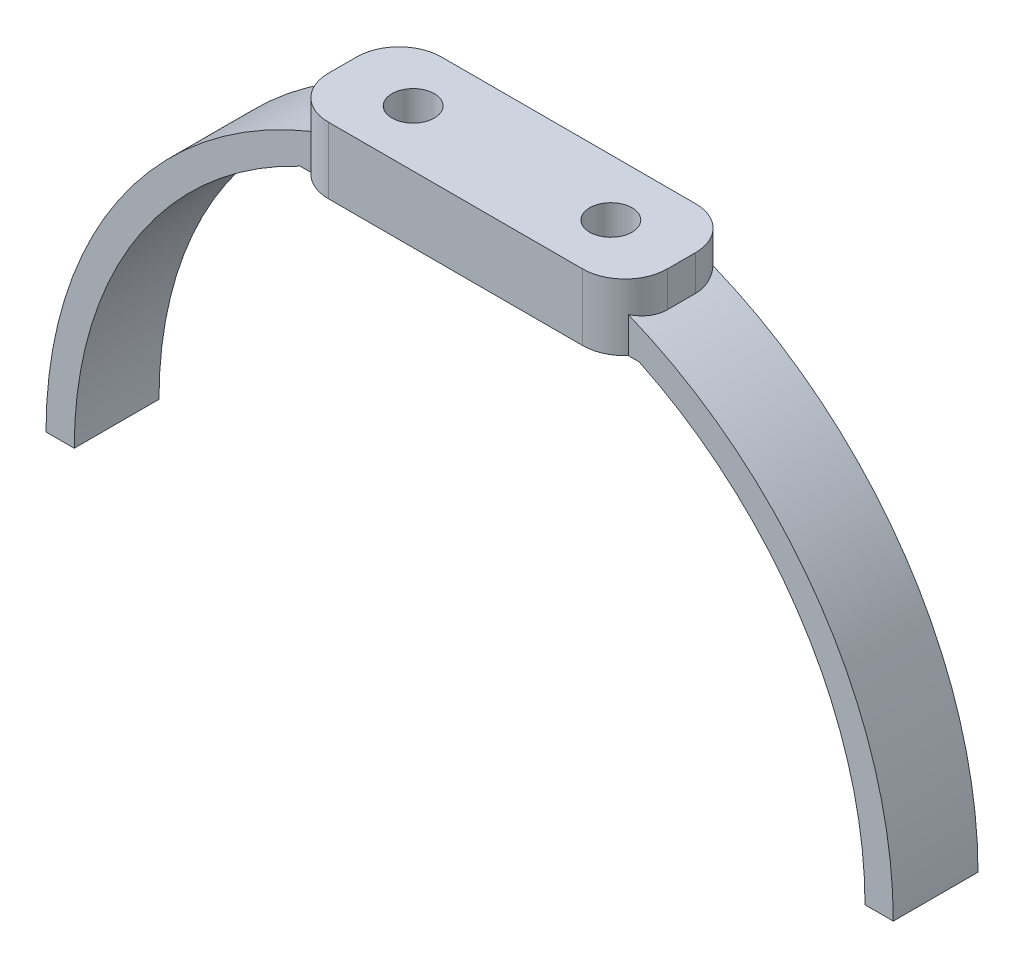
ISO-10303-21;
HEADER;
FILE_DESCRIPTION(('STEP AP214'),'2;1');
FILE_NAME('part.step','',(''),(''),'','','');
FILE_SCHEMA(('AUTOMOTIVE_DESIGN { 1 0 10303 214 1 1 1 1 }'));
ENDSEC;
DATA;
#1=APPLICATION_CONTEXT('core data for automotive mechanical design processes');
#2=APPLICATION_PROTOCOL_DEFINITION('international standard','automotive_design',2000,#1);
#3=PRODUCT_CONTEXT('',#1,'mechanical');
#4=PRODUCT('Part','Part','',(#3));
#5=PRODUCT_RELATED_PRODUCT_CATEGORY('part','',(#4));
#6=PRODUCT_DEFINITION_FORMATION('','',#4);
#7=PRODUCT_DEFINITION_CONTEXT('part definition',#1,'design');
#8=PRODUCT_DEFINITION('design','',#6,#7);
#9=PRODUCT_DEFINITION_SHAPE('','',#8);
#10=(LENGTH_UNIT() NAMED_UNIT(*) SI_UNIT(.MILLI.,.METRE.));
#11=(NAMED_UNIT(*) PLANE_ANGLE_UNIT() SI_UNIT($,.RADIAN.));
#12=(NAMED_UNIT(*) SI_UNIT($,.STERADIAN.) SOLID_ANGLE_UNIT());
#13=UNCERTAINTY_MEASURE_WITH_UNIT(LENGTH_MEASURE(1.E-05),#10,'distance_accuracy_value','');
#14=(GEOMETRIC_REPRESENTATION_CONTEXT(3) GLOBAL_UNCERTAINTY_ASSIGNED_CONTEXT((#13)) GLOBAL_UNIT_ASSIGNED_CONTEXT((#10,
#11,#12)) REPRESENTATION_CONTEXT('',''));
#15=CARTESIAN_POINT('',(0.,0.,0.));
#16=DIRECTION('',(0.,0.,1.));
#17=DIRECTION('',(1.,0.,0.));
#18=AXIS2_PLACEMENT_3D('',#15,#16,#17);
#19=CARTESIAN_POINT('',(-12.,-1.,-4.));
#20=DIRECTION('',(-1.,0.,0.));
#21=DIRECTION('',(0.,0.,1.));
#22=AXIS2_PLACEMENT_3D('',#19,#20,#21);
#23=PLANE('',#22);
#24=DIRECTION('',(0.,0.,1.));
#25=VECTOR('',#24,1.);
#26=CARTESIAN_POINT('',(-12.,-2.50454583026497,-3.));
#27=LINE('',#26,#25);
#28=CARTESIAN_POINT('',(-12.,-2.50454583026497,-1.));
#29=VERTEX_POINT('',#28);
#30=CARTESIAN_POINT('',(-12.,-2.50454583026497,1.));
#31=VERTEX_POINT('',#30);
#32=EDGE_CURVE('E225',#29,#31,#27,.T.);
#33=ORIENTED_EDGE('',*,*,#32,.T.);
#34=DIRECTION('',(0.,1.,0.));
#35=VECTOR('',#34,1.);
#36=CARTESIAN_POINT('',(-12.,-1.,1.));
#37=LINE('',#36,#35);
#38=CARTESIAN_POINT('',(-12.,0.,1.));
#39=VERTEX_POINT('',#38);
#40=EDGE_CURVE('E259',#31,#39,#37,.T.);
#41=ORIENTED_EDGE('',*,*,#40,.T.);
#42=DIRECTION('',(0.,0.,1.));
#43=VECTOR('',#42,1.);
#44=CARTESIAN_POINT('',(-12.,0.,-4.));
#45=LINE('',#44,#43);
#46=CARTESIAN_POINT('',(-12.,0.,-1.));
#47=VERTEX_POINT('',#46);
#48=EDGE_CURVE('E239',#47,#39,#45,.T.);
#49=ORIENTED_EDGE('',*,*,#48,.F.);
#50=DIRECTION('',(0.,1.,0.));
#51=VECTOR('',#50,1.);
#52=CARTESIAN_POINT('',(-12.,-1.,-1.));
#53=LINE('',#52,#51);
#54=EDGE_CURVE('E251',#47,#29,#53,.F.);
#55=ORIENTED_EDGE('',*,*,#54,.T.);
#56=EDGE_LOOP('',(#33,#41,#49,#55));
#57=FACE_BOUND('',#56,.T.);
#58=ADVANCED_FACE('F37',(#57),#23,.T.);
#59=CARTESIAN_POINT('',(12.,-1.,-4.));
#60=DIRECTION('',(1.,0.,0.));
#61=DIRECTION('',(0.,0.,-1.));
#62=AXIS2_PLACEMENT_3D('',#59,#60,#61);
#63=PLANE('',#62);
#64=DIRECTION('',(0.,0.,-1.));
#65=VECTOR('',#64,1.);
#66=CARTESIAN_POINT('',(12.,0.,-4.));
#67=LINE('',#66,#65);
#68=CARTESIAN_POINT('',(12.,0.,1.));
#69=VERTEX_POINT('',#68);
#70=CARTESIAN_POINT('',(12.,0.,-1.));
#71=VERTEX_POINT('',#70);
#72=EDGE_CURVE('E245',#69,#71,#67,.T.);
#73=ORIENTED_EDGE('',*,*,#72,.F.);
#74=DIRECTION('',(0.,1.,0.));
#75=VECTOR('',#74,1.);
#76=CARTESIAN_POINT('',(12.,-1.,1.));
#77=LINE('',#76,#75);
#78=CARTESIAN_POINT('',(12.,-2.50454583026497,1.));
#79=VERTEX_POINT('',#78);
#80=EDGE_CURVE('E301',#69,#79,#77,.F.);
#81=ORIENTED_EDGE('',*,*,#80,.T.);
#82=DIRECTION('',(0.,0.,1.));
#83=VECTOR('',#82,1.);
#84=CARTESIAN_POINT('',(12.,-2.50454583026497,-3.));
#85=LINE('',#84,#83);
#86=CARTESIAN_POINT('',(12.,-2.50454583026497,-1.));
#87=VERTEX_POINT('',#86);
#88=EDGE_CURVE('E219',#79,#87,#85,.F.);
#89=ORIENTED_EDGE('',*,*,#88,.T.);
#90=DIRECTION('',(0.,1.,0.));
#91=VECTOR('',#90,1.);
#92=CARTESIAN_POINT('',(12.,-1.,-1.));
#93=LINE('',#92,#91);
#94=EDGE_CURVE('E298',#87,#71,#93,.T.);
#95=ORIENTED_EDGE('',*,*,#94,.T.);
#96=EDGE_LOOP('',(#73,#81,#89,#95));
#97=FACE_BOUND('',#96,.T.);
#98=ADVANCED_FACE('F359',(#97),#63,.T.);
#99=CARTESIAN_POINT('',(12.,-1.,-4.));
#100=DIRECTION('',(0.,0.,-1.));
#101=DIRECTION('',(-1.,0.,0.));
#102=AXIS2_PLACEMENT_3D('',#99,#100,#101);
#103=PLANE('',#102);
#104=DIRECTION('',(1.,0.,0.));
#105=VECTOR('',#104,1.);
#106=CARTESIAN_POINT('',(-12.,-4.70177871865297,-4.));
#107=LINE('',#106,#105);
#108=CARTESIAN_POINT('',(-9.,-4.70177871865297,-4.));
#109=VERTEX_POINT('',#108);
#110=CARTESIAN_POINT('',(9.00000000000001,-4.70177871865297,-4.));
#111=VERTEX_POINT('',#110);
#112=EDGE_CURVE('E231',#109,#111,#107,.T.);
#113=ORIENTED_EDGE('',*,*,#112,.F.);
#114=DIRECTION('',(0.,1.,0.));
#115=VECTOR('',#114,1.);
#116=CARTESIAN_POINT('',(-9.,-1.,-4.));
#117=LINE('',#116,#115);
#118=CARTESIAN_POINT('',(-8.99999999999999,0.,-4.));
#119=VERTEX_POINT('',#118);
#120=EDGE_CURVE('E295',#109,#119,#117,.T.);
#121=ORIENTED_EDGE('',*,*,#120,.T.);
#122=DIRECTION('',(-1.,0.,0.));
#123=VECTOR('',#122,1.);
#124=CARTESIAN_POINT('',(12.,0.,-4.));
#125=LINE('',#124,#123);
#126=CARTESIAN_POINT('',(9.00000000000001,0.,-4.));
#127=VERTEX_POINT('',#126);
#128=EDGE_CURVE('E248',#127,#119,#125,.T.);
#129=ORIENTED_EDGE('',*,*,#128,.F.);
#130=DIRECTION('',(0.,1.,0.));
#131=VECTOR('',#130,1.);
#132=CARTESIAN_POINT('',(9.00000000000001,-1.,-4.));
#133=LINE('',#132,#131);
#134=EDGE_CURVE('E293',#127,#111,#133,.F.);
#135=ORIENTED_EDGE('',*,*,#134,.T.);
#136=EDGE_LOOP('',(#113,#121,#129,#135));
#137=FACE_BOUND('',#136,.T.);
#138=ADVANCED_FACE('F379',(#137),#103,.T.);
#139=CARTESIAN_POINT('',(12.,-1.,4.));
#140=DIRECTION('',(0.,0.,1.));
#141=DIRECTION('',(1.,0.,0.));
#142=AXIS2_PLACEMENT_3D('',#139,#140,#141);
#143=PLANE('',#142);
#144=DIRECTION('',(1.,0.,0.));
#145=VECTOR('',#144,1.);
#146=CARTESIAN_POINT('',(12.,0.,4.));
#147=LINE('',#146,#145);
#148=CARTESIAN_POINT('',(-9.,0.,4.));
#149=VERTEX_POINT('',#148);
#150=CARTESIAN_POINT('',(9.,0.,4.));
#151=VERTEX_POINT('',#150);
#152=EDGE_CURVE('E242',#149,#151,#147,.T.);
#153=ORIENTED_EDGE('',*,*,#152,.F.);
#154=DIRECTION('',(0.,1.,0.));
#155=VECTOR('',#154,1.);
#156=CARTESIAN_POINT('',(-9.,-1.,4.));
#157=LINE('',#156,#155);
#158=CARTESIAN_POINT('',(-9.,-4.70177871865297,4.));
#159=VERTEX_POINT('',#158);
#160=EDGE_CURVE('E273',#149,#159,#157,.F.);
#161=ORIENTED_EDGE('',*,*,#160,.T.);
#162=DIRECTION('',(1.,0.,0.));
#163=VECTOR('',#162,1.);
#164=CARTESIAN_POINT('',(-12.,-4.70177871865297,4.));
#165=LINE('',#164,#163);
#166=CARTESIAN_POINT('',(9.00000000000001,-4.70177871865297,4.));
#167=VERTEX_POINT('',#166);
#168=EDGE_CURVE('E228',#159,#167,#165,.T.);
#169=ORIENTED_EDGE('',*,*,#168,.T.);
#170=DIRECTION('',(0.,1.,0.));
#171=VECTOR('',#170,1.);
#172=CARTESIAN_POINT('',(9.,-1.,4.));
#173=LINE('',#172,#171);
#174=EDGE_CURVE('E270',#167,#151,#173,.T.);
#175=ORIENTED_EDGE('',*,*,#174,.T.);
#176=EDGE_LOOP('',(#153,#161,#169,#175));
#177=FACE_BOUND('',#176,.T.);
#178=ADVANCED_FACE('F387',(#177),#143,.T.);
#179=CARTESIAN_POINT('',(0.,0.,0.));
#180=DIRECTION('',(0.,-1.,0.));
#181=DIRECTION('',(0.,0.,-1.));
#182=AXIS2_PLACEMENT_3D('',#179,#180,#181);
#183=PLANE('',#182);
#184=CARTESIAN_POINT('',(-7.,0.,0.));
#185=DIRECTION('',(0.,1.,0.));
#186=DIRECTION('',(0.,0.,1.));
#187=AXIS2_PLACEMENT_3D('',#184,#185,#186);
#188=CIRCLE('',#187,1.5);
#189=CARTESIAN_POINT('',(-7.,0.,1.5));
#190=VERTEX_POINT('',#189);
#191=EDGE_CURVE('E255',#190,#190,#188,.T.);
#192=ORIENTED_EDGE('',*,*,#191,.F.);
#193=EDGE_LOOP('',(#192));
#194=FACE_BOUND('',#193,.T.);
#195=CARTESIAN_POINT('',(7.,0.,0.));
#196=DIRECTION('',(0.,1.,0.));
#197=DIRECTION('',(0.,0.,1.));
#198=AXIS2_PLACEMENT_3D('',#195,#196,#197);
#199=CIRCLE('',#198,1.5);
#200=CARTESIAN_POINT('',(7.,0.,1.5));
#201=VERTEX_POINT('',#200);
#202=EDGE_CURVE('E199',#201,#201,#199,.T.);
#203=ORIENTED_EDGE('',*,*,#202,.F.);
#204=EDGE_LOOP('',(#203));
#205=FACE_BOUND('',#204,.T.);
#206=ORIENTED_EDGE('',*,*,#48,.T.);
#207=CARTESIAN_POINT('',(-9.,0.,1.));
#208=DIRECTION('',(0.,-1.,0.));
#209=DIRECTION('',(0.,0.,-1.));
#210=AXIS2_PLACEMENT_3D('',#207,#208,#209);
#211=CIRCLE('',#210,3.);
#212=EDGE_CURVE('E268',#39,#149,#211,.F.);
#213=ORIENTED_EDGE('',*,*,#212,.T.);
#214=ORIENTED_EDGE('',*,*,#152,.T.);
#215=CARTESIAN_POINT('',(9.,0.,0.999999999999999));
#216=DIRECTION('',(0.,-1.,0.));
#217=DIRECTION('',(0.,0.,-1.));
#218=AXIS2_PLACEMENT_3D('',#215,#216,#217);
#219=CIRCLE('',#218,3.);
#220=EDGE_CURVE('E264',#151,#69,#219,.F.);
#221=ORIENTED_EDGE('',*,*,#220,.T.);
#222=ORIENTED_EDGE('',*,*,#72,.T.);
#223=CARTESIAN_POINT('',(9.00000000000001,0.,-1.));
#224=DIRECTION('',(0.,-1.,0.));
#225=DIRECTION('',(0.,0.,-1.));
#226=AXIS2_PLACEMENT_3D('',#223,#224,#225);
#227=CIRCLE('',#226,3.);
#228=EDGE_CURVE('E262',#71,#127,#227,.F.);
#229=ORIENTED_EDGE('',*,*,#228,.T.);
#230=ORIENTED_EDGE('',*,*,#128,.T.);
#231=CARTESIAN_POINT('',(-9.,0.,-1.));
#232=DIRECTION('',(0.,-1.,0.));
#233=DIRECTION('',(0.,0.,-1.));
#234=AXIS2_PLACEMENT_3D('',#231,#232,#233);
#235=CIRCLE('',#234,3.);
#236=EDGE_CURVE('E266',#119,#47,#235,.F.);
#237=ORIENTED_EDGE('',*,*,#236,.T.);
#238=EDGE_LOOP('',(#206,#213,#214,#221,#222,#229,#230,#237));
#239=FACE_BOUND('',#238,.T.);
#240=ADVANCED_FACE('F382',(#194,#205,#239),#183,.F.);
#241=CARTESIAN_POINT('',(-12.,-4.70177871865297,-28.4562205403692));
#242=DIRECTION('',(0.,-1.,0.));
#243=DIRECTION('',(0.,0.,-1.));
#244=AXIS2_PLACEMENT_3D('',#241,#242,#243);
#245=PLANE('',#244);
#246=CARTESIAN_POINT('',(-7.,-4.70177871865297,0.));
#247=DIRECTION('',(0.,-1.,0.));
#248=DIRECTION('',(0.,0.,-1.));
#249=AXIS2_PLACEMENT_3D('',#246,#247,#248);
#250=CIRCLE('',#249,1.5);
#251=CARTESIAN_POINT('',(-7.,-4.70177871865297,1.5));
#252=VERTEX_POINT('',#251);
#253=EDGE_CURVE('E197',#252,#252,#250,.T.);
#254=ORIENTED_EDGE('',*,*,#253,.F.);
#255=EDGE_LOOP('',(#254));
#256=FACE_BOUND('',#255,.T.);
#257=CARTESIAN_POINT('',(7.,-4.70177871865297,0.));
#258=DIRECTION('',(0.,-1.,0.));
#259=DIRECTION('',(0.,0.,-1.));
#260=AXIS2_PLACEMENT_3D('',#257,#258,#259);
#261=CIRCLE('',#260,1.5);
#262=CARTESIAN_POINT('',(7.,-4.70177871865297,1.5));
#263=VERTEX_POINT('',#262);
#264=EDGE_CURVE('E252',#263,#263,#261,.T.);
#265=ORIENTED_EDGE('',*,*,#264,.F.);
#266=EDGE_LOOP('',(#265));
#267=FACE_BOUND('',#266,.T.);
#268=CARTESIAN_POINT('',(-9.,-4.70177871865297,1.));
#269=DIRECTION('',(0.,-1.,0.));
#270=DIRECTION('',(0.,0.,-1.));
#271=AXIS2_PLACEMENT_3D('',#268,#269,#270);
#272=CIRCLE('',#271,3.);
#273=CARTESIAN_POINT('',(-11.2360679774998,-4.70177871865297,3.));
#274=VERTEX_POINT('',#273);
#275=EDGE_CURVE('E288',#159,#274,#272,.T.);
#276=ORIENTED_EDGE('',*,*,#275,.T.);
#277=DIRECTION('',(-1.,0.,0.));
#278=VECTOR('',#277,1.);
#279=CARTESIAN_POINT('',(-12.,-4.70177871865297,3.));
#280=LINE('',#279,#278);
#281=CARTESIAN_POINT('',(-12.,-4.70177871865297,3.));
#282=VERTEX_POINT('',#281);
#283=EDGE_CURVE('E291',#274,#282,#280,.T.);
#284=ORIENTED_EDGE('',*,*,#283,.T.);
#285=DIRECTION('',(0.,0.,1.));
#286=VECTOR('',#285,1.);
#287=CARTESIAN_POINT('',(-12.,-4.70177871865297,-28.4562205403692));
#288=LINE('',#287,#286);
#289=CARTESIAN_POINT('',(-12.,-4.70177871865297,-3.));
#290=VERTEX_POINT('',#289);
#291=EDGE_CURVE('E236',#290,#282,#288,.T.);
#292=ORIENTED_EDGE('',*,*,#291,.F.);
#293=DIRECTION('',(1.,0.,0.));
#294=VECTOR('',#293,1.);
#295=CARTESIAN_POINT('',(0.,-4.70177871865297,-3.));
#296=LINE('',#295,#294);
#297=CARTESIAN_POINT('',(-11.2360679774998,-4.70177871865297,-3.));
#298=VERTEX_POINT('',#297);
#299=EDGE_CURVE('E285',#290,#298,#296,.T.);
#300=ORIENTED_EDGE('',*,*,#299,.T.);
#301=CARTESIAN_POINT('',(-9.,-4.70177871865297,-1.));
#302=DIRECTION('',(0.,-1.,0.));
#303=DIRECTION('',(0.,0.,-1.));
#304=AXIS2_PLACEMENT_3D('',#301,#302,#303);
#305=CIRCLE('',#304,3.);
#306=EDGE_CURVE('E283',#298,#109,#305,.T.);
#307=ORIENTED_EDGE('',*,*,#306,.T.);
#308=ORIENTED_EDGE('',*,*,#112,.T.);
#309=CARTESIAN_POINT('',(9.00000000000001,-4.70177871865297,-1.));
#310=DIRECTION('',(0.,-1.,0.));
#311=DIRECTION('',(0.,0.,-1.));
#312=AXIS2_PLACEMENT_3D('',#309,#310,#311);
#313=CIRCLE('',#312,3.);
#314=CARTESIAN_POINT('',(11.2360679774998,-4.70177871865297,-3.));
#315=VERTEX_POINT('',#314);
#316=EDGE_CURVE('E275',#111,#315,#313,.T.);
#317=ORIENTED_EDGE('',*,*,#316,.T.);
#318=DIRECTION('',(1.,0.,0.));
#319=VECTOR('',#318,1.);
#320=CARTESIAN_POINT('',(0.,-4.70177871865297,-3.));
#321=LINE('',#320,#319);
#322=CARTESIAN_POINT('',(12.,-4.70177871865297,-3.));
#323=VERTEX_POINT('',#322);
#324=EDGE_CURVE('E278',#315,#323,#321,.T.);
#325=ORIENTED_EDGE('',*,*,#324,.T.);
#326=DIRECTION('',(0.,0.,1.));
#327=VECTOR('',#326,1.);
#328=CARTESIAN_POINT('',(12.,-4.70177871865297,-28.4562205403692));
#329=LINE('',#328,#327);
#330=CARTESIAN_POINT('',(12.,-4.70177871865297,3.));
#331=VERTEX_POINT('',#330);
#332=EDGE_CURVE('E234',#323,#331,#329,.T.);
#333=ORIENTED_EDGE('',*,*,#332,.T.);
#334=DIRECTION('',(-1.,0.,0.));
#335=VECTOR('',#334,1.);
#336=CARTESIAN_POINT('',(-12.,-4.70177871865297,3.));
#337=LINE('',#336,#335);
#338=CARTESIAN_POINT('',(11.2360679774998,-4.70177871865297,3.));
#339=VERTEX_POINT('',#338);
#340=EDGE_CURVE('E65',#331,#339,#337,.T.);
#341=ORIENTED_EDGE('',*,*,#340,.T.);
#342=CARTESIAN_POINT('',(9.,-4.70177871865297,0.999999999999999));
#343=DIRECTION('',(0.,-1.,0.));
#344=DIRECTION('',(0.,0.,-1.));
#345=AXIS2_PLACEMENT_3D('',#342,#343,#344);
#346=CIRCLE('',#345,3.);
#347=EDGE_CURVE('E280',#339,#167,#346,.T.);
#348=ORIENTED_EDGE('',*,*,#347,.T.);
#349=ORIENTED_EDGE('',*,*,#168,.F.);
#350=EDGE_LOOP('',(#276,#284,#292,#300,#307,#308,#317,#325,#333,#341,#348,#349));
#351=FACE_BOUND('',#350,.T.);
#352=ADVANCED_FACE('F374',(#256,#267,#351),#245,.T.);
#353=CARTESIAN_POINT('',(0.,-30.,-3.));
#354=DIRECTION('',(0.,-1.,0.));
#355=DIRECTION('',(1.,0.,0.));
#356=AXIS2_PLACEMENT_3D('',#353,#354,#355);
#357=PLANE('',#356);
#358=DIRECTION('',(0.,0.,1.));
#359=VECTOR('',#358,1.);
#360=CARTESIAN_POINT('',(-28.,-30.,-3.));
#361=LINE('',#360,#359);
#362=CARTESIAN_POINT('',(-28.,-30.,-3.));
#363=VERTEX_POINT('',#362);
#364=CARTESIAN_POINT('',(-28.,-30.,3.));
#365=VERTEX_POINT('',#364);
#366=EDGE_CURVE('E179',#363,#365,#361,.T.);
#367=ORIENTED_EDGE('',*,*,#366,.T.);
#368=DIRECTION('',(1.,0.,0.));
#369=VECTOR('',#368,1.);
#370=CARTESIAN_POINT('',(0.,-30.,3.));
#371=LINE('',#370,#369);
#372=CARTESIAN_POINT('',(-30.,-30.,3.));
#373=VERTEX_POINT('',#372);
#374=EDGE_CURVE('E184',#373,#365,#371,.T.);
#375=ORIENTED_EDGE('',*,*,#374,.F.);
#376=DIRECTION('',(0.,0.,1.));
#377=VECTOR('',#376,1.);
#378=CARTESIAN_POINT('',(-30.,-30.,-3.));
#379=LINE('',#378,#377);
#380=CARTESIAN_POINT('',(-30.,-30.,-3.));
#381=VERTEX_POINT('',#380);
#382=EDGE_CURVE('E167',#381,#373,#379,.T.);
#383=ORIENTED_EDGE('',*,*,#382,.F.);
#384=DIRECTION('',(1.,0.,0.));
#385=VECTOR('',#384,1.);
#386=CARTESIAN_POINT('',(0.,-30.,-3.));
#387=LINE('',#386,#385);
#388=EDGE_CURVE('E209',#381,#363,#387,.T.);
#389=ORIENTED_EDGE('',*,*,#388,.T.);
#390=EDGE_LOOP('',(#367,#375,#383,#389));
#391=FACE_BOUND('',#390,.T.);
#392=ADVANCED_FACE('F185',(#391),#357,.T.);
#393=CARTESIAN_POINT('',(0.,-30.,-3.));
#394=DIRECTION('',(0.,0.,1.));
#395=DIRECTION('',(1.,0.,0.));
#396=AXIS2_PLACEMENT_3D('',#393,#394,#395);
#397=CYLINDRICAL_SURFACE('',#396,28.);
#398=ORIENTED_EDGE('',*,*,#291,.T.);
#399=CARTESIAN_POINT('',(0.,-30.,3.));
#400=DIRECTION('',(0.,0.,1.));
#401=DIRECTION('',(1.,0.,0.));
#402=AXIS2_PLACEMENT_3D('',#399,#400,#401);
#403=CIRCLE('',#402,28.);
#404=EDGE_CURVE('E189',#282,#365,#403,.T.);
#405=ORIENTED_EDGE('',*,*,#404,.T.);
#406=ORIENTED_EDGE('',*,*,#366,.F.);
#407=CARTESIAN_POINT('',(0.,-30.,-3.));
#408=DIRECTION('',(0.,0.,1.));
#409=DIRECTION('',(1.,0.,0.));
#410=AXIS2_PLACEMENT_3D('',#407,#408,#409);
#411=CIRCLE('',#410,28.);
#412=EDGE_CURVE('E211',#290,#363,#411,.T.);
#413=ORIENTED_EDGE('',*,*,#412,.F.);
#414=EDGE_LOOP('',(#398,#405,#406,#413));
#415=FACE_BOUND('',#414,.T.);
#416=ADVANCED_FACE('F394',(#415),#397,.F.);
#417=CARTESIAN_POINT('',(0.,0.,3.));
#418=DIRECTION('',(0.,0.,1.));
#419=DIRECTION('',(1.,0.,0.));
#420=AXIS2_PLACEMENT_3D('',#417,#418,#419);
#421=PLANE('',#420);
#422=ORIENTED_EDGE('',*,*,#404,.F.);
#423=ORIENTED_EDGE('',*,*,#283,.F.);
#424=DIRECTION('',(0.,1.,0.));
#425=VECTOR('',#424,1.);
#426=CARTESIAN_POINT('',(-11.2360679774998,-4.70177871865297,3.));
#427=LINE('',#426,#425);
#428=CARTESIAN_POINT('',(-11.2360679774998,-2.18362395269644,3.));
#429=VERTEX_POINT('',#428);
#430=EDGE_CURVE('E193',#274,#429,#427,.T.);
#431=ORIENTED_EDGE('',*,*,#430,.T.);
#432=CARTESIAN_POINT('',(0.,-30.,3.));
#433=DIRECTION('',(0.,0.,1.));
#434=DIRECTION('',(1.,0.,0.));
#435=AXIS2_PLACEMENT_3D('',#432,#433,#434);
#436=CIRCLE('',#435,30.);
#437=EDGE_CURVE('E172',#373,#429,#436,.F.);
#438=ORIENTED_EDGE('',*,*,#437,.F.);
#439=ORIENTED_EDGE('',*,*,#374,.T.);
#440=EDGE_LOOP('',(#422,#423,#431,#438,#439));
#441=FACE_BOUND('',#440,.T.);
#442=ADVANCED_FACE('F191',(#441),#421,.T.);
#443=CARTESIAN_POINT('',(0.,0.,-3.));
#444=DIRECTION('',(0.,0.,1.));
#445=DIRECTION('',(1.,0.,0.));
#446=AXIS2_PLACEMENT_3D('',#443,#444,#445);
#447=PLANE('',#446);
#448=CARTESIAN_POINT('',(0.,-30.,-3.));
#449=DIRECTION('',(0.,0.,1.));
#450=DIRECTION('',(1.,0.,0.));
#451=AXIS2_PLACEMENT_3D('',#448,#449,#450);
#452=CIRCLE('',#451,30.);
#453=CARTESIAN_POINT('',(-11.2360679774998,-2.18362395269644,-3.));
#454=VERTEX_POINT('',#453);
#455=EDGE_CURVE('E175',#381,#454,#452,.F.);
#456=ORIENTED_EDGE('',*,*,#455,.T.);
#457=DIRECTION('',(0.,1.,0.));
#458=VECTOR('',#457,1.);
#459=CARTESIAN_POINT('',(-11.2360679774998,-2.18362395269644,-3.));
#460=LINE('',#459,#458);
#461=EDGE_CURVE('E346',#454,#298,#460,.F.);
#462=ORIENTED_EDGE('',*,*,#461,.T.);
#463=ORIENTED_EDGE('',*,*,#299,.F.);
#464=ORIENTED_EDGE('',*,*,#412,.T.);
#465=ORIENTED_EDGE('',*,*,#388,.F.);
#466=EDGE_LOOP('',(#456,#462,#463,#464,#465));
#467=FACE_BOUND('',#466,.T.);
#468=ADVANCED_FACE('F396',(#467),#447,.F.);
#469=CARTESIAN_POINT('',(0.,-30.,-3.));
#470=DIRECTION('',(0.,0.,1.));
#471=DIRECTION('',(1.,0.,0.));
#472=AXIS2_PLACEMENT_3D('',#469,#470,#471);
#473=CYLINDRICAL_SURFACE('',#472,30.);
#474=ORIENTED_EDGE('',*,*,#32,.F.);
#475=CARTESIAN_POINT('',(-12.,-2.50454583026497,-1.));
#476=CARTESIAN_POINT('',(-12.0000116508908,-2.50455361974256,-1.07964164215168));
#477=CARTESIAN_POINT('',(-11.9968289087143,-2.50316191681134,-1.15927669742798));
#478=CARTESIAN_POINT('',(-11.9841637109118,-2.49763815268034,-1.31793111117391));
#479=CARTESIAN_POINT('',(-11.974682684851,-2.49350671333788,-1.3969506052449));
#480=CARTESIAN_POINT('',(-11.9495363660656,-2.48257355309095,-1.55364323735845));
#481=CARTESIAN_POINT('',(-11.9338841106457,-2.47577746168219,-1.6313188556634));
#482=CARTESIAN_POINT('',(-11.8965755851713,-2.45963145936757,-1.78492255575859));
#483=CARTESIAN_POINT('',(-11.8749193339947,-2.45028155649143,-1.86085064304261));
#484=CARTESIAN_POINT('',(-11.8012749013587,-2.41861490374486,-2.08515762241286));
#485=CARTESIAN_POINT('',(-11.7405773450568,-2.39266632634331,-2.23026574156006));
#486=CARTESIAN_POINT('',(-11.5982588181241,-2.3325769880799,-2.50776793419078));
#487=CARTESIAN_POINT('',(-11.5166555559766,-2.29844316221004,-2.64017263845287));
#488=CARTESIAN_POINT('',(-11.3962170849982,-2.24883289311674,-2.80574548139191));
#489=CARTESIAN_POINT('',(-11.3654555846042,-2.23621797246826,-2.8458521327375));
#490=CARTESIAN_POINT('',(-11.3021152803523,-2.21037321106122,-2.92426487474758));
#491=CARTESIAN_POINT('',(-11.2695400124035,-2.19714457458979,-2.96257421780517));
#492=CARTESIAN_POINT('',(-11.2360679774998,-2.18362395269645,-3.00000000000004));
#493=B_SPLINE_CURVE_WITH_KNOTS('',3,(#475,#476,#477,#478,#479,#480,#481,#482,#483,#484,#485,
#486,#487,#488,#489,#490,#491,#492),.UNSPECIFIED.,.F.,.F.,(4,2,2,2,2,2,2,2,4),(0.,
0.23883810923312,0.477622026239741,0.715904169644452,0.954185563847927,1.43012710505429,
1.90566681839587,2.06190619722835,2.21785098486379),.UNSPECIFIED.);
#494=EDGE_CURVE('E311',#29,#454,#493,.T.);
#495=ORIENTED_EDGE('',*,*,#494,.T.);
#496=ORIENTED_EDGE('',*,*,#455,.F.);
#497=ORIENTED_EDGE('',*,*,#382,.T.);
#498=ORIENTED_EDGE('',*,*,#437,.T.);
#499=CARTESIAN_POINT('',(-11.2360679774998,-2.18362395269644,3.));
#500=CARTESIAN_POINT('',(-11.2893038158973,-2.20512762234726,2.9404902157938));
#501=CARTESIAN_POINT('',(-11.3402921235255,-2.22590178208596,2.8786923494516));
#502=CARTESIAN_POINT('',(-11.4374144372886,-2.26575574728186,2.75084205762489));
#503=CARTESIAN_POINT('',(-11.4835465839547,-2.28483490327327,2.68478801790684));
#504=CARTESIAN_POINT('',(-11.570721128601,-2.32111541370612,2.54853504033457));
#505=CARTESIAN_POINT('',(-11.6117435601762,-2.3383093721642,2.47832133300519));
#506=CARTESIAN_POINT('',(-11.688121393454,-2.37049518819782,2.33440536430843));
#507=CARTESIAN_POINT('',(-11.7234777057597,-2.38548739958405,2.26070366596771));
#508=CARTESIAN_POINT('',(-11.7882818936355,-2.41308906300284,2.11005700773445));
#509=CARTESIAN_POINT('',(-11.8177126814476,-2.42569161793684,2.0331034209667));
#510=CARTESIAN_POINT('',(-11.870230874664,-2.44825891282139,1.87668664672165));
#511=CARTESIAN_POINT('',(-11.8933186753349,-2.45822381713712,1.79722361596588));
#512=CARTESIAN_POINT('',(-11.9328332751959,-2.47532102882401,1.63663604020486));
#513=CARTESIAN_POINT('',(-11.9492813236175,-2.48246237092236,1.55551768259541));
#514=CARTESIAN_POINT('',(-11.9754245548062,-2.49382956945134,1.39203720316082));
#515=CARTESIAN_POINT('',(-11.9851241091388,-2.49805731324706,1.30967592188087));
#516=CARTESIAN_POINT('',(-11.9942640536532,-2.50204303078607,1.18926068853092));
#517=CARTESIAN_POINT('',(-11.996415266998,-2.50298154404675,1.15143184611019));
#518=CARTESIAN_POINT('',(-11.9992827152639,-2.5042327620055,1.07573704928408));
#519=CARTESIAN_POINT('',(-11.9999999926994,-2.50454592135441,1.03787114187992));
#520=CARTESIAN_POINT('',(-12.,-2.50454583026497,1.));
#521=B_SPLINE_CURVE_WITH_KNOTS('',3,(#499,#500,#501,#502,#503,#504,#505,#506,#507,#508,#509,
#510,#511,#512,#513,#514,#515,#516,#517,#518,#519,#520),.UNSPECIFIED.,.F.,.F.,(4,2,2,2,2,2,2,2,
2,2,4),(0.,0.248024508334717,0.496143644705848,0.745203773442749,0.994223835459154,
1.24395203676712,1.49366467260001,1.74257169262674,1.99131732420547,2.10499491557526,
2.21858982982953),.UNSPECIFIED.);
#522=EDGE_CURVE('E304',#429,#31,#521,.T.);
#523=ORIENTED_EDGE('',*,*,#522,.T.);
#524=EDGE_LOOP('',(#474,#495,#496,#497,#498,#523));
#525=FACE_BOUND('',#524,.T.);
#526=ADVANCED_FACE('F170',(#525),#473,.T.);
#527=ORIENTED_EDGE('',*,*,#332,.F.);
#528=CARTESIAN_POINT('',(28.,-30.,-3.));
#529=VERTEX_POINT('',#528);
#530=EDGE_CURVE('E212',#529,#323,#411,.T.);
#531=ORIENTED_EDGE('',*,*,#530,.F.);
#532=DIRECTION('',(0.,0.,1.));
#533=VECTOR('',#532,1.);
#534=CARTESIAN_POINT('',(28.,-30.,-3.));
#535=LINE('',#534,#533);
#536=CARTESIAN_POINT('',(28.,-30.,3.));
#537=VERTEX_POINT('',#536);
#538=EDGE_CURVE('E220',#529,#537,#535,.T.);
#539=ORIENTED_EDGE('',*,*,#538,.T.);
#540=EDGE_CURVE('E202',#537,#331,#403,.T.);
#541=ORIENTED_EDGE('',*,*,#540,.T.);
#542=EDGE_LOOP('',(#527,#531,#539,#541));
#543=FACE_BOUND('',#542,.T.);
#544=ADVANCED_FACE('F371',(#543),#397,.F.);
#545=ORIENTED_EDGE('',*,*,#88,.F.);
#546=CARTESIAN_POINT('',(12.,-2.50454583026497,1.));
#547=CARTESIAN_POINT('',(12.0000116508908,-2.50455361974256,1.07964164215168));
#548=CARTESIAN_POINT('',(11.9968289087143,-2.50316191681134,1.15927669742798));
#549=CARTESIAN_POINT('',(11.9841637109118,-2.49763815268034,1.31793111117391));
#550=CARTESIAN_POINT('',(11.974682684851,-2.49350671333788,1.3969506052449));
#551=CARTESIAN_POINT('',(11.9495363660656,-2.48257355309095,1.55364323735844));
#552=CARTESIAN_POINT('',(11.9338841106457,-2.47577746168219,1.6313188556634));
#553=CARTESIAN_POINT('',(11.8965755851713,-2.45963145936757,1.78492255575859));
#554=CARTESIAN_POINT('',(11.8749193339947,-2.45028155649143,1.86085064304261));
#555=CARTESIAN_POINT('',(11.8012749013587,-2.41861490374486,2.08515762241286));
#556=CARTESIAN_POINT('',(11.7405773450568,-2.39266632634331,2.23026574156006));
#557=CARTESIAN_POINT('',(11.5982588181241,-2.3325769880799,2.50776793419078));
#558=CARTESIAN_POINT('',(11.5166555559766,-2.29844316221003,2.64017263845287));
#559=CARTESIAN_POINT('',(11.3962170849982,-2.24883289311673,2.80574548139191));
#560=CARTESIAN_POINT('',(11.3654555846042,-2.23621797246826,2.8458521327375));
#561=CARTESIAN_POINT('',(11.3021152803523,-2.21037321106121,2.92426487474758));
#562=CARTESIAN_POINT('',(11.2695400124035,-2.19714457458979,2.96257421780518));
#563=CARTESIAN_POINT('',(11.2360679774998,-2.18362395269645,3.00000000000004));
#564=B_SPLINE_CURVE_WITH_KNOTS('',3,(#546,#547,#548,#549,#550,#551,#552,#553,#554,#555,#556,
#557,#558,#559,#560,#561,#562,#563),.UNSPECIFIED.,.F.,.F.,(4,2,2,2,2,2,2,2,4),(0.,
0.23883810923312,0.477622026239742,0.715904169644452,0.954185563847927,1.4301271050543,
1.90566681839587,2.06190619722835,2.21785098486379),.UNSPECIFIED.);
#565=CARTESIAN_POINT('',(11.2360679774998,-2.18362395269644,3.));
#566=VERTEX_POINT('',#565);
#567=EDGE_CURVE('E338',#79,#566,#564,.T.);
#568=ORIENTED_EDGE('',*,*,#567,.T.);
#569=CARTESIAN_POINT('',(30.,-30.,3.));
#570=VERTEX_POINT('',#569);
#571=EDGE_CURVE('E195',#566,#570,#436,.F.);
#572=ORIENTED_EDGE('',*,*,#571,.T.);
#573=DIRECTION('',(0.,0.,1.));
#574=VECTOR('',#573,1.);
#575=CARTESIAN_POINT('',(30.,-30.,-3.));
#576=LINE('',#575,#574);
#577=CARTESIAN_POINT('',(30.,-30.,-3.));
#578=VERTEX_POINT('',#577);
#579=EDGE_CURVE('E216',#578,#570,#576,.T.);
#580=ORIENTED_EDGE('',*,*,#579,.F.);
#581=CARTESIAN_POINT('',(11.2360679774998,-2.18362395269644,-3.));
#582=VERTEX_POINT('',#581);
#583=EDGE_CURVE('E57',#582,#578,#452,.F.);
#584=ORIENTED_EDGE('',*,*,#583,.F.);
#585=CARTESIAN_POINT('',(11.2360679774998,-2.18362395269644,-3.));
#586=CARTESIAN_POINT('',(11.2893038158973,-2.20512762234726,-2.9404902157938));
#587=CARTESIAN_POINT('',(11.3402921235255,-2.22590178208596,-2.8786923494516));
#588=CARTESIAN_POINT('',(11.4374144372886,-2.26575574728186,-2.75084205762489));
#589=CARTESIAN_POINT('',(11.4835465839547,-2.28483490327327,-2.68478801790684));
#590=CARTESIAN_POINT('',(11.570721128601,-2.32111541370612,-2.54853504033457));
#591=CARTESIAN_POINT('',(11.6117435601762,-2.3383093721642,-2.47832133300518));
#592=CARTESIAN_POINT('',(11.688121393454,-2.37049518819782,-2.33440536430843));
#593=CARTESIAN_POINT('',(11.7234777057597,-2.38548739958405,-2.26070366596771));
#594=CARTESIAN_POINT('',(11.7882818936355,-2.41308906300284,-2.11005700773444));
#595=CARTESIAN_POINT('',(11.8177126814476,-2.42569161793683,-2.0331034209667));
#596=CARTESIAN_POINT('',(11.870230874664,-2.44825891282139,-1.87668664672165));
#597=CARTESIAN_POINT('',(11.8933186753349,-2.45822381713712,-1.79722361596588));
#598=CARTESIAN_POINT('',(11.9328332751959,-2.47532102882401,-1.63663604020486));
#599=CARTESIAN_POINT('',(11.9492813236175,-2.48246237092236,-1.55551768259541));
#600=CARTESIAN_POINT('',(11.9754245548062,-2.49382956945133,-1.39203720316082));
#601=CARTESIAN_POINT('',(11.9851241091388,-2.49805731324705,-1.30967592188087));
#602=CARTESIAN_POINT('',(11.9942640536532,-2.50204303078607,-1.18926068853092));
#603=CARTESIAN_POINT('',(11.996415266998,-2.50298154404675,-1.15143184611019));
#604=CARTESIAN_POINT('',(11.9992827152639,-2.5042327620055,-1.07573704928408));
#605=CARTESIAN_POINT('',(11.9999999926994,-2.50454592135442,-1.03787114187992));
#606=CARTESIAN_POINT('',(12.,-2.50454583026496,-1.));
#607=B_SPLINE_CURVE_WITH_KNOTS('',3,(#585,#586,#587,#588,#589,#590,#591,#592,#593,#594,#595,
#596,#597,#598,#599,#600,#601,#602,#603,#604,#605,#606),.UNSPECIFIED.,.F.,.F.,(4,2,2,2,2,2,2,2,
2,2,4),(0.,0.248024508334717,0.496143644705848,0.745203773442751,0.994223835459155,
1.24395203676712,1.49366467260001,1.74257169262674,1.99131732420547,2.10499491557526,
2.21858982982952),.UNSPECIFIED.);
#608=EDGE_CURVE('E11',#582,#87,#607,.T.);
#609=ORIENTED_EDGE('',*,*,#608,.T.);
#610=EDGE_LOOP('',(#545,#568,#572,#580,#584,#609));
#611=FACE_BOUND('',#610,.T.);
#612=ADVANCED_FACE('F318',(#611),#473,.T.);
#613=CARTESIAN_POINT('',(0.,-30.,-3.));
#614=DIRECTION('',(0.,1.,0.));
#615=DIRECTION('',(-1.,0.,0.));
#616=AXIS2_PLACEMENT_3D('',#613,#614,#615);
#617=PLANE('',#616);
#618=ORIENTED_EDGE('',*,*,#579,.T.);
#619=DIRECTION('',(-1.,0.,0.));
#620=VECTOR('',#619,1.);
#621=CARTESIAN_POINT('',(0.,-30.,3.));
#622=LINE('',#621,#620);
#623=EDGE_CURVE('E205',#570,#537,#622,.T.);
#624=ORIENTED_EDGE('',*,*,#623,.T.);
#625=ORIENTED_EDGE('',*,*,#538,.F.);
#626=DIRECTION('',(-1.,0.,0.));
#627=VECTOR('',#626,1.);
#628=CARTESIAN_POINT('',(0.,-30.,-3.));
#629=LINE('',#628,#627);
#630=EDGE_CURVE('E180',#578,#529,#629,.T.);
#631=ORIENTED_EDGE('',*,*,#630,.F.);
#632=EDGE_LOOP('',(#618,#624,#625,#631));
#633=FACE_BOUND('',#632,.T.);
#634=ADVANCED_FACE('F366',(#633),#617,.F.);
#635=ORIENTED_EDGE('',*,*,#530,.T.);
#636=ORIENTED_EDGE('',*,*,#324,.F.);
#637=DIRECTION('',(0.,1.,0.));
#638=VECTOR('',#637,1.);
#639=CARTESIAN_POINT('',(11.2360679774998,-4.70177871865297,-3.));
#640=LINE('',#639,#638);
#641=EDGE_CURVE('E51',#315,#582,#640,.T.);
#642=ORIENTED_EDGE('',*,*,#641,.T.);
#643=ORIENTED_EDGE('',*,*,#583,.T.);
#644=ORIENTED_EDGE('',*,*,#630,.T.);
#645=EDGE_LOOP('',(#635,#636,#642,#643,#644));
#646=FACE_BOUND('',#645,.T.);
#647=ADVANCED_FACE('F350',(#646),#447,.F.);
#648=ORIENTED_EDGE('',*,*,#571,.F.);
#649=DIRECTION('',(0.,1.,0.));
#650=VECTOR('',#649,1.);
#651=CARTESIAN_POINT('',(11.2360679774998,-2.18362395269643,3.));
#652=LINE('',#651,#650);
#653=EDGE_CURVE('E345',#566,#339,#652,.F.);
#654=ORIENTED_EDGE('',*,*,#653,.T.);
#655=ORIENTED_EDGE('',*,*,#340,.F.);
#656=ORIENTED_EDGE('',*,*,#540,.F.);
#657=ORIENTED_EDGE('',*,*,#623,.F.);
#658=EDGE_LOOP('',(#648,#654,#655,#656,#657));
#659=FACE_BOUND('',#658,.T.);
#660=ADVANCED_FACE('F368',(#659),#421,.T.);
#661=CARTESIAN_POINT('',(7.,-30.,0.));
#662=DIRECTION('',(0.,1.,0.));
#663=DIRECTION('',(0.,0.,1.));
#664=AXIS2_PLACEMENT_3D('',#661,#662,#663);
#665=CYLINDRICAL_SURFACE('',#664,1.5);
#666=CARTESIAN_POINT('',(7.,-4.70177871865297,1.5));
#667=CARTESIAN_POINT('',(7.,-4.65280185700034,1.5));
#668=CARTESIAN_POINT('',(7.,-4.6038249953477,1.5));
#669=CARTESIAN_POINT('',(7.,-4.50587127204243,1.5));
#670=CARTESIAN_POINT('',(7.,-4.4568944103898,1.5));
#671=CARTESIAN_POINT('',(7.,-4.35894068708453,1.5));
#672=CARTESIAN_POINT('',(7.,-4.30996382543189,1.5));
#673=CARTESIAN_POINT('',(7.,-4.21201010212662,1.5));
#674=CARTESIAN_POINT('',(7.,-4.16303324047399,1.5));
#675=CARTESIAN_POINT('',(7.,-4.06507951716872,1.5));
#676=CARTESIAN_POINT('',(7.,-4.01610265551608,1.5));
#677=CARTESIAN_POINT('',(7.,-3.91814893221081,1.5));
#678=CARTESIAN_POINT('',(7.,-3.86917207055818,1.5));
#679=CARTESIAN_POINT('',(7.,-3.77121834725291,1.5));
#680=CARTESIAN_POINT('',(7.,-3.72224148560027,1.5));
#681=CARTESIAN_POINT('',(7.,-3.624287762295,1.5));
#682=CARTESIAN_POINT('',(7.,-3.57531090064237,1.5));
#683=CARTESIAN_POINT('',(7.,-3.4773571773371,1.5));
#684=CARTESIAN_POINT('',(7.,-3.42838031568446,1.5));
#685=CARTESIAN_POINT('',(7.,-3.33042659237919,1.5));
#686=CARTESIAN_POINT('',(7.,-3.28144973072656,1.5));
#687=CARTESIAN_POINT('',(7.,-3.18349600742129,1.5));
#688=CARTESIAN_POINT('',(7.,-3.13451914576865,1.5));
#689=CARTESIAN_POINT('',(7.,-3.03656542246338,1.5));
#690=CARTESIAN_POINT('',(7.,-2.98758856081074,1.5));
#691=CARTESIAN_POINT('',(7.,-2.88963483750547,1.5));
#692=CARTESIAN_POINT('',(7.,-2.84065797585284,1.5));
#693=CARTESIAN_POINT('',(7.,-2.74270425254757,1.5));
#694=CARTESIAN_POINT('',(7.,-2.69372739089493,1.5));
#695=CARTESIAN_POINT('',(7.,-2.59577366758966,1.5));
#696=CARTESIAN_POINT('',(7.,-2.54679680593703,1.5));
#697=CARTESIAN_POINT('',(7.,-2.44884308263176,1.5));
#698=CARTESIAN_POINT('',(7.,-2.39986622097912,1.5));
#699=CARTESIAN_POINT('',(7.,-2.30191249767385,1.5));
#700=CARTESIAN_POINT('',(7.,-2.25293563602122,1.5));
#701=CARTESIAN_POINT('',(7.,-2.15498191271595,1.5));
#702=CARTESIAN_POINT('',(7.,-2.10600505106331,1.5));
#703=CARTESIAN_POINT('',(7.,-2.00805132775804,1.5));
#704=CARTESIAN_POINT('',(7.,-1.95907446610541,1.5));
#705=CARTESIAN_POINT('',(7.,-1.86112074280014,1.5));
#706=CARTESIAN_POINT('',(7.,-1.8121438811475,1.5));
#707=CARTESIAN_POINT('',(7.,-1.71419015784223,1.5));
#708=CARTESIAN_POINT('',(7.,-1.66521329618959,1.5));
#709=CARTESIAN_POINT('',(7.,-1.56725957288432,1.5));
#710=CARTESIAN_POINT('',(7.,-1.51828271123169,1.5));
#711=CARTESIAN_POINT('',(7.,-1.42032898792642,1.5));
#712=CARTESIAN_POINT('',(7.,-1.37135212627378,1.5));
#713=CARTESIAN_POINT('',(7.,-1.27339840296851,1.5));
#714=CARTESIAN_POINT('',(7.,-1.22442154131588,1.5));
#715=CARTESIAN_POINT('',(7.,-1.12646781801061,1.5));
#716=CARTESIAN_POINT('',(7.,-1.07749095635797,1.5));
#717=CARTESIAN_POINT('',(7.,-0.979537233052704,1.5));
#718=CARTESIAN_POINT('',(7.,-0.930560371400069,1.5));
#719=CARTESIAN_POINT('',(7.,-0.832606648094797,1.5));
#720=CARTESIAN_POINT('',(7.,-0.783629786442161,1.5));
#721=CARTESIAN_POINT('',(7.,-0.68567606313689,1.5));
#722=CARTESIAN_POINT('',(7.,-0.636699201484255,1.5));
#723=CARTESIAN_POINT('',(7.,-0.538745478178985,1.5));
#724=CARTESIAN_POINT('',(7.,-0.48976861652635,1.5));
#725=CARTESIAN_POINT('',(7.,-0.39181489322108,1.5));
#726=CARTESIAN_POINT('',(7.,-0.342838031568445,1.5));
#727=CARTESIAN_POINT('',(7.,-0.244884308263175,1.5));
#728=CARTESIAN_POINT('',(7.,-0.19590744661054,1.5));
#729=CARTESIAN_POINT('',(7.,-0.09795372330527,1.5));
#730=CARTESIAN_POINT('',(7.,-0.048976861652635,1.5));
#731=CARTESIAN_POINT('',(7.,0.,1.5));
#732=B_SPLINE_CURVE_WITH_KNOTS('',3,(#666,#667,#668,#669,#670,#671,#672,#673,#674,#675,#676,
#677,#678,#679,#680,#681,#682,#683,#684,#685,#686,#687,#688,#689,#690,#691,#692,#693,#694,#695,
#696,#697,#698,#699,#700,#701,#702,#703,#704,#705,#706,#707,#708,#709,#710,#711,#712,#713,#714,
#715,#716,#717,#718,#719,#720,#721,#722,#723,#724,#725,#726,#727,#728,#729,#730,#731),
.UNSPECIFIED.,.F.,.F.,(4,2,2,2,2,2,2,2,2,2,2,2,2,2,2,2,2,2,2,2,2,2,2,2,2,2,2,2,2,2,2,2,4),(0.,
0.146930584957905,0.29386116991581,0.440791754873715,0.58772233983162,0.734652924789528,
0.881583509747433,1.02851409470534,1.17544467966324,1.32237526462115,1.46930584957905,
1.61623643453696,1.76316701949487,1.91009760445277,2.05702818941068,2.20395877436858,
2.35088935932649,2.49781994428439,2.6447505292423,2.7916811142002,2.93861169915811,
3.08554228411602,3.23247286907392,3.37940345403183,3.52633403898973,3.67326462394764,
3.82019520890554,3.96712579386345,4.11405637882135,4.26098696377926,4.40791754873716,
4.55484813369507,4.70177871865297),.UNSPECIFIED.);
#733=EDGE_CURVE('BSEAM429',#263,#201,#732,.T.);
#734=ORIENTED_EDGE('',*,*,#264,.T.);
#735=ORIENTED_EDGE('',*,*,#202,.T.);
#736=ORIENTED_EDGE('',*,*,#733,.T.);
#737=ORIENTED_EDGE('',*,*,#733,.F.);
#738=EDGE_LOOP('',(#734,#736,#735,#737));
#739=FACE_BOUND('',#738,.T.);
#740=ADVANCED_FACE('F429',(#739),#665,.F.);
#741=CARTESIAN_POINT('',(-7.,-30.,0.));
#742=DIRECTION('',(0.,1.,0.));
#743=DIRECTION('',(0.,0.,1.));
#744=AXIS2_PLACEMENT_3D('',#741,#742,#743);
#745=CYLINDRICAL_SURFACE('',#744,1.5);
#746=CARTESIAN_POINT('',(-7.,-4.70177871865297,1.5));
#747=CARTESIAN_POINT('',(-7.,-4.65280185700034,1.5));
#748=CARTESIAN_POINT('',(-7.,-4.6038249953477,1.5));
#749=CARTESIAN_POINT('',(-7.,-4.50587127204243,1.5));
#750=CARTESIAN_POINT('',(-7.,-4.4568944103898,1.5));
#751=CARTESIAN_POINT('',(-7.,-4.35894068708453,1.5));
#752=CARTESIAN_POINT('',(-7.,-4.30996382543189,1.5));
#753=CARTESIAN_POINT('',(-7.,-4.21201010212662,1.5));
#754=CARTESIAN_POINT('',(-7.,-4.16303324047399,1.5));
#755=CARTESIAN_POINT('',(-7.,-4.06507951716872,1.5));
#756=CARTESIAN_POINT('',(-7.,-4.01610265551608,1.5));
#757=CARTESIAN_POINT('',(-7.,-3.91814893221081,1.5));
#758=CARTESIAN_POINT('',(-7.,-3.86917207055818,1.5));
#759=CARTESIAN_POINT('',(-7.,-3.77121834725291,1.5));
#760=CARTESIAN_POINT('',(-7.,-3.72224148560027,1.5));
#761=CARTESIAN_POINT('',(-7.,-3.624287762295,1.5));
#762=CARTESIAN_POINT('',(-7.,-3.57531090064237,1.5));
#763=CARTESIAN_POINT('',(-7.,-3.4773571773371,1.5));
#764=CARTESIAN_POINT('',(-7.,-3.42838031568446,1.5));
#765=CARTESIAN_POINT('',(-7.,-3.33042659237919,1.5));
#766=CARTESIAN_POINT('',(-7.,-3.28144973072656,1.5));
#767=CARTESIAN_POINT('',(-7.,-3.18349600742129,1.5));
#768=CARTESIAN_POINT('',(-7.,-3.13451914576865,1.5));
#769=CARTESIAN_POINT('',(-7.,-3.03656542246338,1.5));
#770=CARTESIAN_POINT('',(-7.,-2.98758856081074,1.5));
#771=CARTESIAN_POINT('',(-7.,-2.88963483750547,1.5));
#772=CARTESIAN_POINT('',(-7.,-2.84065797585284,1.5));
#773=CARTESIAN_POINT('',(-7.,-2.74270425254757,1.5));
#774=CARTESIAN_POINT('',(-7.,-2.69372739089493,1.5));
#775=CARTESIAN_POINT('',(-7.,-2.59577366758966,1.5));
#776=CARTESIAN_POINT('',(-7.,-2.54679680593703,1.5));
#777=CARTESIAN_POINT('',(-7.,-2.44884308263176,1.5));
#778=CARTESIAN_POINT('',(-7.,-2.39986622097912,1.5));
#779=CARTESIAN_POINT('',(-7.,-2.30191249767385,1.5));
#780=CARTESIAN_POINT('',(-7.,-2.25293563602122,1.5));
#781=CARTESIAN_POINT('',(-7.,-2.15498191271595,1.5));
#782=CARTESIAN_POINT('',(-7.,-2.10600505106331,1.5));
#783=CARTESIAN_POINT('',(-7.,-2.00805132775804,1.5));
#784=CARTESIAN_POINT('',(-7.,-1.95907446610541,1.5));
#785=CARTESIAN_POINT('',(-7.,-1.86112074280014,1.5));
#786=CARTESIAN_POINT('',(-7.,-1.8121438811475,1.5));
#787=CARTESIAN_POINT('',(-7.,-1.71419015784223,1.5));
#788=CARTESIAN_POINT('',(-7.,-1.66521329618959,1.5));
#789=CARTESIAN_POINT('',(-7.,-1.56725957288432,1.5));
#790=CARTESIAN_POINT('',(-7.,-1.51828271123169,1.5));
#791=CARTESIAN_POINT('',(-7.,-1.42032898792642,1.5));
#792=CARTESIAN_POINT('',(-7.,-1.37135212627378,1.5));
#793=CARTESIAN_POINT('',(-7.,-1.27339840296851,1.5));
#794=CARTESIAN_POINT('',(-7.,-1.22442154131588,1.5));
#795=CARTESIAN_POINT('',(-7.,-1.12646781801061,1.5));
#796=CARTESIAN_POINT('',(-7.,-1.07749095635797,1.5));
#797=CARTESIAN_POINT('',(-7.,-0.979537233052704,1.5));
#798=CARTESIAN_POINT('',(-7.,-0.930560371400069,1.5));
#799=CARTESIAN_POINT('',(-7.,-0.832606648094797,1.5));
#800=CARTESIAN_POINT('',(-7.,-0.783629786442161,1.5));
#801=CARTESIAN_POINT('',(-7.,-0.68567606313689,1.5));
#802=CARTESIAN_POINT('',(-7.,-0.636699201484255,1.5));
#803=CARTESIAN_POINT('',(-7.,-0.538745478178985,1.5));
#804=CARTESIAN_POINT('',(-7.,-0.48976861652635,1.5));
#805=CARTESIAN_POINT('',(-7.,-0.39181489322108,1.5));
#806=CARTESIAN_POINT('',(-7.,-0.342838031568445,1.5));
#807=CARTESIAN_POINT('',(-7.,-0.244884308263175,1.5));
#808=CARTESIAN_POINT('',(-7.,-0.19590744661054,1.5));
#809=CARTESIAN_POINT('',(-7.,-0.09795372330527,1.5));
#810=CARTESIAN_POINT('',(-7.,-0.048976861652635,1.5));
#811=CARTESIAN_POINT('',(-7.,0.,1.5));
#812=B_SPLINE_CURVE_WITH_KNOTS('',3,(#746,#747,#748,#749,#750,#751,#752,#753,#754,#755,#756,
#757,#758,#759,#760,#761,#762,#763,#764,#765,#766,#767,#768,#769,#770,#771,#772,#773,#774,#775,
#776,#777,#778,#779,#780,#781,#782,#783,#784,#785,#786,#787,#788,#789,#790,#791,#792,#793,#794,
#795,#796,#797,#798,#799,#800,#801,#802,#803,#804,#805,#806,#807,#808,#809,#810,#811),
.UNSPECIFIED.,.F.,.F.,(4,2,2,2,2,2,2,2,2,2,2,2,2,2,2,2,2,2,2,2,2,2,2,2,2,2,2,2,2,2,2,2,4),(0.,
0.146930584957905,0.29386116991581,0.440791754873715,0.58772233983162,0.734652924789528,
0.881583509747433,1.02851409470534,1.17544467966324,1.32237526462115,1.46930584957905,
1.61623643453696,1.76316701949487,1.91009760445277,2.05702818941068,2.20395877436858,
2.35088935932649,2.49781994428439,2.6447505292423,2.7916811142002,2.93861169915811,
3.08554228411602,3.23247286907392,3.37940345403183,3.52633403898973,3.67326462394764,
3.82019520890554,3.96712579386345,4.11405637882135,4.26098696377926,4.40791754873716,
4.55484813369507,4.70177871865297),.UNSPECIFIED.);
#813=EDGE_CURVE('BSEAM327',#252,#190,#812,.T.);
#814=ORIENTED_EDGE('',*,*,#253,.T.);
#815=ORIENTED_EDGE('',*,*,#191,.T.);
#816=ORIENTED_EDGE('',*,*,#813,.T.);
#817=ORIENTED_EDGE('',*,*,#813,.F.);
#818=EDGE_LOOP('',(#814,#816,#815,#817));
#819=FACE_BOUND('',#818,.T.);
#820=ADVANCED_FACE('F327',(#819),#745,.F.);
#821=CARTESIAN_POINT('',(-9.,-1.,1.));
#822=DIRECTION('',(0.,1.,0.));
#823=DIRECTION('',(0.,0.,1.));
#824=AXIS2_PLACEMENT_3D('',#821,#822,#823);
#825=CYLINDRICAL_SURFACE('',#824,3.);
#826=ORIENTED_EDGE('',*,*,#275,.F.);
#827=ORIENTED_EDGE('',*,*,#160,.F.);
#828=ORIENTED_EDGE('',*,*,#212,.F.);
#829=ORIENTED_EDGE('',*,*,#40,.F.);
#830=ORIENTED_EDGE('',*,*,#522,.F.);
#831=ORIENTED_EDGE('',*,*,#430,.F.);
#832=EDGE_LOOP('',(#826,#827,#828,#829,#830,#831));
#833=FACE_BOUND('',#832,.T.);
#834=ADVANCED_FACE('F322',(#833),#825,.T.);
#835=CARTESIAN_POINT('',(-9.,-1.,-1.));
#836=DIRECTION('',(0.,1.,0.));
#837=DIRECTION('',(0.,0.,1.));
#838=AXIS2_PLACEMENT_3D('',#835,#836,#837);
#839=CYLINDRICAL_SURFACE('',#838,3.);
#840=ORIENTED_EDGE('',*,*,#494,.F.);
#841=ORIENTED_EDGE('',*,*,#54,.F.);
#842=ORIENTED_EDGE('',*,*,#236,.F.);
#843=ORIENTED_EDGE('',*,*,#120,.F.);
#844=ORIENTED_EDGE('',*,*,#306,.F.);
#845=ORIENTED_EDGE('',*,*,#461,.F.);
#846=EDGE_LOOP('',(#840,#841,#842,#843,#844,#845));
#847=FACE_BOUND('',#846,.T.);
#848=ADVANCED_FACE('F326',(#847),#839,.T.);
#849=CARTESIAN_POINT('',(9.,-1.,0.999999999999999));
#850=DIRECTION('',(0.,1.,0.));
#851=DIRECTION('',(0.,0.,1.));
#852=AXIS2_PLACEMENT_3D('',#849,#850,#851);
#853=CYLINDRICAL_SURFACE('',#852,3.);
#854=ORIENTED_EDGE('',*,*,#567,.F.);
#855=ORIENTED_EDGE('',*,*,#80,.F.);
#856=ORIENTED_EDGE('',*,*,#220,.F.);
#857=ORIENTED_EDGE('',*,*,#174,.F.);
#858=ORIENTED_EDGE('',*,*,#347,.F.);
#859=ORIENTED_EDGE('',*,*,#653,.F.);
#860=EDGE_LOOP('',(#854,#855,#856,#857,#858,#859));
#861=FACE_BOUND('',#860,.T.);
#862=ADVANCED_FACE('F332',(#861),#853,.T.);
#863=CARTESIAN_POINT('',(9.00000000000001,-1.,-1.));
#864=DIRECTION('',(0.,1.,0.));
#865=DIRECTION('',(0.,0.,1.));
#866=AXIS2_PLACEMENT_3D('',#863,#864,#865);
#867=CYLINDRICAL_SURFACE('',#866,3.);
#868=ORIENTED_EDGE('',*,*,#316,.F.);
#869=ORIENTED_EDGE('',*,*,#134,.F.);
#870=ORIENTED_EDGE('',*,*,#228,.F.);
#871=ORIENTED_EDGE('',*,*,#94,.F.);
#872=ORIENTED_EDGE('',*,*,#608,.F.);
#873=ORIENTED_EDGE('',*,*,#641,.F.);
#874=EDGE_LOOP('',(#868,#869,#870,#871,#872,#873));
#875=FACE_BOUND('',#874,.T.);
#876=ADVANCED_FACE('F39',(#875),#867,.T.);
#877=CLOSED_SHELL('',(#58,#98,#138,#178,#240,#352,#392,#416,#442,#468,#526,#544,#612,#634,#647,
#660,#740,#820,#834,#848,#862,#876));
#878=MANIFOLD_SOLID_BREP('B2',#877);
#879=ADVANCED_BREP_SHAPE_REPRESENTATION('',(#18,#878),#14);
#880=SHAPE_DEFINITION_REPRESENTATION(#9,#879);
ENDSEC;
END-ISO-10303-21;
